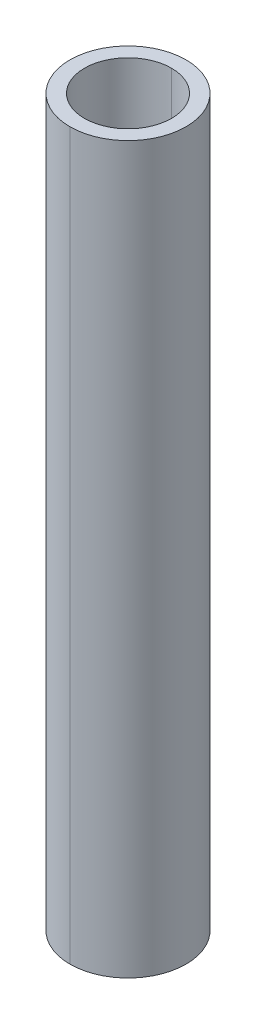
ISO-10303-21;
HEADER;
FILE_DESCRIPTION(('STEP AP214'),'2;1');
FILE_NAME('part.step','',(''),(''),'','','');
FILE_SCHEMA(('AUTOMOTIVE_DESIGN { 1 0 10303 214 1 1 1 1 }'));
ENDSEC;
DATA;
#1=APPLICATION_CONTEXT('core data for automotive mechanical design processes');
#2=APPLICATION_PROTOCOL_DEFINITION('international standard','automotive_design',2000,#1);
#3=PRODUCT_CONTEXT('',#1,'mechanical');
#4=PRODUCT('Part','Part','',(#3));
#5=PRODUCT_RELATED_PRODUCT_CATEGORY('part','',(#4));
#6=PRODUCT_DEFINITION_FORMATION('','',#4);
#7=PRODUCT_DEFINITION_CONTEXT('part definition',#1,'design');
#8=PRODUCT_DEFINITION('design','',#6,#7);
#9=PRODUCT_DEFINITION_SHAPE('','',#8);
#10=(LENGTH_UNIT() NAMED_UNIT(*) SI_UNIT(.MILLI.,.METRE.));
#11=(NAMED_UNIT(*) PLANE_ANGLE_UNIT() SI_UNIT($,.RADIAN.));
#12=(NAMED_UNIT(*) SI_UNIT($,.STERADIAN.) SOLID_ANGLE_UNIT());
#13=UNCERTAINTY_MEASURE_WITH_UNIT(LENGTH_MEASURE(1.E-05),#10,'distance_accuracy_value','');
#14=(GEOMETRIC_REPRESENTATION_CONTEXT(3) GLOBAL_UNCERTAINTY_ASSIGNED_CONTEXT((#13)) GLOBAL_UNIT_ASSIGNED_CONTEXT((#10,
#11,#12)) REPRESENTATION_CONTEXT('',''));
#15=CARTESIAN_POINT('',(0.,0.,0.));
#16=DIRECTION('',(0.,0.,1.));
#17=DIRECTION('',(1.,0.,0.));
#18=AXIS2_PLACEMENT_3D('',#15,#16,#17);
#19=CARTESIAN_POINT('',(0.,50.,0.));
#20=DIRECTION('',(0.,-1.,0.));
#21=DIRECTION('',(0.,0.,-1.));
#22=AXIS2_PLACEMENT_3D('',#19,#20,#21);
#23=CYLINDRICAL_SURFACE('',#22,3.);
#24=DIRECTION('',(0.,-1.,0.));
#25=VECTOR('',#24,1.);
#26=CARTESIAN_POINT('',(0.,50.,3.));
#27=LINE('',#26,#25);
#28=CARTESIAN_POINT('',(0.,50.,3.));
#29=VERTEX_POINT('',#28);
#30=CARTESIAN_POINT('',(0.,0.,3.));
#31=VERTEX_POINT('',#30);
#32=EDGE_CURVE('E100',#29,#31,#27,.T.);
#33=ORIENTED_EDGE('',*,*,#32,.F.);
#34=CARTESIAN_POINT('',(0.,50.,0.));
#35=DIRECTION('',(0.,1.,0.));
#36=DIRECTION('',(0.,0.,1.));
#37=AXIS2_PLACEMENT_3D('',#34,#35,#36);
#38=CIRCLE('',#37,3.);
#39=CARTESIAN_POINT('',(0.,50.,-3.));
#40=VERTEX_POINT('',#39);
#41=EDGE_CURVE('E76',#29,#40,#38,.T.);
#42=ORIENTED_EDGE('',*,*,#41,.T.);
#43=DIRECTION('',(0.,-1.,0.));
#44=VECTOR('',#43,1.);
#45=CARTESIAN_POINT('',(0.,50.,-3.));
#46=LINE('',#45,#44);
#47=CARTESIAN_POINT('',(0.,0.,-3.));
#48=VERTEX_POINT('',#47);
#49=EDGE_CURVE('E88',#40,#48,#46,.T.);
#50=ORIENTED_EDGE('',*,*,#49,.T.);
#51=CARTESIAN_POINT('',(0.,0.,0.));
#52=DIRECTION('',(0.,1.,0.));
#53=DIRECTION('',(0.,0.,1.));
#54=AXIS2_PLACEMENT_3D('',#51,#52,#53);
#55=CIRCLE('',#54,3.);
#56=EDGE_CURVE('E9',#31,#48,#55,.T.);
#57=ORIENTED_EDGE('',*,*,#56,.F.);
#58=EDGE_LOOP('',(#33,#42,#50,#57));
#59=FACE_BOUND('',#58,.T.);
#60=ADVANCED_FACE('F14',(#59),#23,.F.);
#61=CARTESIAN_POINT('',(0.,50.,0.));
#62=DIRECTION('',(0.,-1.,0.));
#63=DIRECTION('',(0.,0.,-1.));
#64=AXIS2_PLACEMENT_3D('',#61,#62,#63);
#65=CYLINDRICAL_SURFACE('',#64,4.);
#66=DIRECTION('',(0.,-1.,0.));
#67=VECTOR('',#66,1.);
#68=CARTESIAN_POINT('',(0.,50.,4.));
#69=LINE('',#68,#67);
#70=CARTESIAN_POINT('',(0.,50.,4.));
#71=VERTEX_POINT('',#70);
#72=CARTESIAN_POINT('',(0.,0.,4.));
#73=VERTEX_POINT('',#72);
#74=EDGE_CURVE('E80',#71,#73,#69,.T.);
#75=ORIENTED_EDGE('',*,*,#74,.F.);
#76=CARTESIAN_POINT('',(0.,50.,0.));
#77=DIRECTION('',(0.,1.,0.));
#78=DIRECTION('',(0.,0.,1.));
#79=AXIS2_PLACEMENT_3D('',#76,#77,#78);
#80=CIRCLE('',#79,4.);
#81=CARTESIAN_POINT('',(0.,50.,-4.));
#82=VERTEX_POINT('',#81);
#83=EDGE_CURVE('E70',#82,#71,#80,.T.);
#84=ORIENTED_EDGE('',*,*,#83,.F.);
#85=DIRECTION('',(0.,-1.,0.));
#86=VECTOR('',#85,1.);
#87=CARTESIAN_POINT('',(0.,50.,-4.));
#88=LINE('',#87,#86);
#89=CARTESIAN_POINT('',(0.,0.,-4.));
#90=VERTEX_POINT('',#89);
#91=EDGE_CURVE('E77',#82,#90,#88,.T.);
#92=ORIENTED_EDGE('',*,*,#91,.T.);
#93=CARTESIAN_POINT('',(0.,0.,0.));
#94=DIRECTION('',(0.,1.,0.));
#95=DIRECTION('',(0.,0.,1.));
#96=AXIS2_PLACEMENT_3D('',#93,#94,#95);
#97=CIRCLE('',#96,4.);
#98=EDGE_CURVE('E24',#90,#73,#97,.T.);
#99=ORIENTED_EDGE('',*,*,#98,.T.);
#100=EDGE_LOOP('',(#75,#84,#92,#99));
#101=FACE_BOUND('',#100,.T.);
#102=ADVANCED_FACE('F81',(#101),#65,.T.);
#103=CARTESIAN_POINT('',(0.,0.,0.));
#104=DIRECTION('',(0.,1.,0.));
#105=DIRECTION('',(1.,0.,0.));
#106=AXIS2_PLACEMENT_3D('',#103,#104,#105);
#107=PLANE('',#106);
#108=CARTESIAN_POINT('',(0.,0.,0.));
#109=DIRECTION('',(0.,1.,0.));
#110=DIRECTION('',(0.,0.,1.));
#111=AXIS2_PLACEMENT_3D('',#108,#109,#110);
#112=CIRCLE('',#111,3.);
#113=EDGE_CURVE('E94',#48,#31,#112,.T.);
#114=ORIENTED_EDGE('',*,*,#113,.T.);
#115=ORIENTED_EDGE('',*,*,#56,.T.);
#116=EDGE_LOOP('',(#114,#115));
#117=FACE_BOUND('',#116,.T.);
#118=ORIENTED_EDGE('',*,*,#98,.F.);
#119=CARTESIAN_POINT('',(0.,0.,0.));
#120=DIRECTION('',(0.,1.,0.));
#121=DIRECTION('',(0.,0.,1.));
#122=AXIS2_PLACEMENT_3D('',#119,#120,#121);
#123=CIRCLE('',#122,4.);
#124=EDGE_CURVE('E85',#73,#90,#123,.T.);
#125=ORIENTED_EDGE('',*,*,#124,.F.);
#126=EDGE_LOOP('',(#118,#125));
#127=FACE_BOUND('',#126,.T.);
#128=ADVANCED_FACE('F16',(#117,#127),#107,.F.);
#129=CARTESIAN_POINT('',(0.,50.,0.));
#130=DIRECTION('',(0.,1.,0.));
#131=DIRECTION('',(1.,0.,0.));
#132=AXIS2_PLACEMENT_3D('',#129,#130,#131);
#133=PLANE('',#132);
#134=CARTESIAN_POINT('',(0.,50.,0.));
#135=DIRECTION('',(0.,1.,0.));
#136=DIRECTION('',(0.,0.,1.));
#137=AXIS2_PLACEMENT_3D('',#134,#135,#136);
#138=CIRCLE('',#137,3.);
#139=EDGE_CURVE('E18',#40,#29,#138,.T.);
#140=ORIENTED_EDGE('',*,*,#139,.F.);
#141=ORIENTED_EDGE('',*,*,#41,.F.);
#142=EDGE_LOOP('',(#140,#141));
#143=FACE_BOUND('',#142,.T.);
#144=ORIENTED_EDGE('',*,*,#83,.T.);
#145=CARTESIAN_POINT('',(0.,50.,0.));
#146=DIRECTION('',(0.,1.,0.));
#147=DIRECTION('',(0.,0.,1.));
#148=AXIS2_PLACEMENT_3D('',#145,#146,#147);
#149=CIRCLE('',#148,4.);
#150=EDGE_CURVE('E73',#71,#82,#149,.T.);
#151=ORIENTED_EDGE('',*,*,#150,.T.);
#152=EDGE_LOOP('',(#144,#151));
#153=FACE_BOUND('',#152,.T.);
#154=ADVANCED_FACE('F71',(#143,#153),#133,.T.);
#155=CARTESIAN_POINT('',(0.,50.,0.));
#156=DIRECTION('',(0.,-1.,0.));
#157=DIRECTION('',(0.,0.,-1.));
#158=AXIS2_PLACEMENT_3D('',#155,#156,#157);
#159=CYLINDRICAL_SURFACE('',#158,4.);
#160=ORIENTED_EDGE('',*,*,#150,.F.);
#161=ORIENTED_EDGE('',*,*,#74,.T.);
#162=ORIENTED_EDGE('',*,*,#124,.T.);
#163=ORIENTED_EDGE('',*,*,#91,.F.);
#164=EDGE_LOOP('',(#160,#161,#162,#163));
#165=FACE_BOUND('',#164,.T.);
#166=ADVANCED_FACE('F86',(#165),#159,.T.);
#167=CARTESIAN_POINT('',(0.,50.,0.));
#168=DIRECTION('',(0.,-1.,0.));
#169=DIRECTION('',(0.,0.,-1.));
#170=AXIS2_PLACEMENT_3D('',#167,#168,#169);
#171=CYLINDRICAL_SURFACE('',#170,3.);
#172=ORIENTED_EDGE('',*,*,#139,.T.);
#173=ORIENTED_EDGE('',*,*,#32,.T.);
#174=ORIENTED_EDGE('',*,*,#113,.F.);
#175=ORIENTED_EDGE('',*,*,#49,.F.);
#176=EDGE_LOOP('',(#172,#173,#174,#175));
#177=FACE_BOUND('',#176,.T.);
#178=ADVANCED_FACE('F114',(#177),#171,.F.);
#179=CLOSED_SHELL('',(#60,#102,#128,#154,#166,#178));
#180=MANIFOLD_SOLID_BREP('B1',#179);
#181=ADVANCED_BREP_SHAPE_REPRESENTATION('',(#18,#180),#14);
#182=SHAPE_DEFINITION_REPRESENTATION(#9,#181);
ENDSEC;
END-ISO-10303-21;
